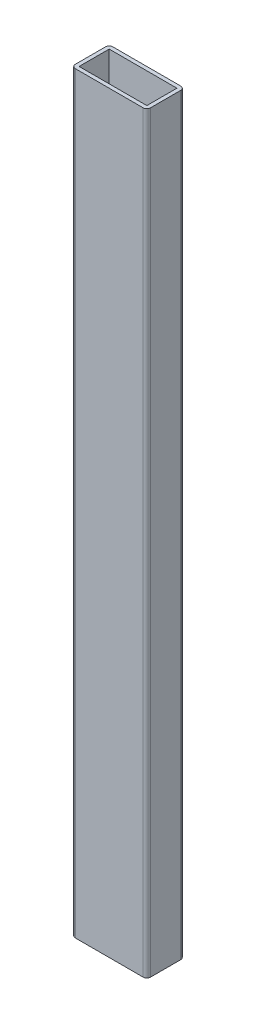
ISO-10303-21;
HEADER;
FILE_DESCRIPTION(('STEP AP214'),'2;1');
FILE_NAME('part.step','',(''),(''),'','','');
FILE_SCHEMA(('AUTOMOTIVE_DESIGN { 1 0 10303 214 1 1 1 1 }'));
ENDSEC;
DATA;
#1=APPLICATION_CONTEXT('core data for automotive mechanical design processes');
#2=APPLICATION_PROTOCOL_DEFINITION('international standard','automotive_design',2000,#1);
#3=PRODUCT_CONTEXT('',#1,'mechanical');
#4=PRODUCT('Part','Part','',(#3));
#5=PRODUCT_RELATED_PRODUCT_CATEGORY('part','',(#4));
#6=PRODUCT_DEFINITION_FORMATION('','',#4);
#7=PRODUCT_DEFINITION_CONTEXT('part definition',#1,'design');
#8=PRODUCT_DEFINITION('design','',#6,#7);
#9=PRODUCT_DEFINITION_SHAPE('','',#8);
#10=(LENGTH_UNIT() NAMED_UNIT(*) SI_UNIT(.MILLI.,.METRE.));
#11=(NAMED_UNIT(*) PLANE_ANGLE_UNIT() SI_UNIT($,.RADIAN.));
#12=(NAMED_UNIT(*) SI_UNIT($,.STERADIAN.) SOLID_ANGLE_UNIT());
#13=UNCERTAINTY_MEASURE_WITH_UNIT(LENGTH_MEASURE(1.E-05),#10,'distance_accuracy_value','');
#14=(GEOMETRIC_REPRESENTATION_CONTEXT(3) GLOBAL_UNCERTAINTY_ASSIGNED_CONTEXT((#13)) GLOBAL_UNIT_ASSIGNED_CONTEXT((#10,
#11,#12)) REPRESENTATION_CONTEXT('',''));
#15=CARTESIAN_POINT('',(0.,0.,0.));
#16=DIRECTION('',(0.,0.,1.));
#17=DIRECTION('',(1.,0.,0.));
#18=AXIS2_PLACEMENT_3D('',#15,#16,#17);
#19=CARTESIAN_POINT('',(-18.,400.,8.));
#20=DIRECTION('',(0.,1.,0.));
#21=DIRECTION('',(0.,0.,1.));
#22=AXIS2_PLACEMENT_3D('',#19,#20,#21);
#23=PLANE('',#22);
#24=CARTESIAN_POINT('',(-18.,400.,8.));
#25=DIRECTION('',(0.,1.,0.));
#26=DIRECTION('',(0.,0.,1.));
#27=AXIS2_PLACEMENT_3D('',#24,#25,#26);
#28=CIRCLE('',#27,2.);
#29=CARTESIAN_POINT('',(-20.,400.,7.99999999999999));
#30=VERTEX_POINT('',#29);
#31=CARTESIAN_POINT('',(-18.,400.,10.));
#32=VERTEX_POINT('',#31);
#33=EDGE_CURVE('E196',#30,#32,#28,.T.);
#34=ORIENTED_EDGE('',*,*,#33,.T.);
#35=DIRECTION('',(1.,0.,0.));
#36=VECTOR('',#35,1.);
#37=CARTESIAN_POINT('',(-18.,400.,10.));
#38=LINE('',#37,#36);
#39=CARTESIAN_POINT('',(18.,400.,10.));
#40=VERTEX_POINT('',#39);
#41=EDGE_CURVE('E199',#32,#40,#38,.T.);
#42=ORIENTED_EDGE('',*,*,#41,.T.);
#43=CARTESIAN_POINT('',(18.,400.,8.));
#44=DIRECTION('',(0.,1.,0.));
#45=DIRECTION('',(0.,0.,1.));
#46=AXIS2_PLACEMENT_3D('',#43,#44,#45);
#47=CIRCLE('',#46,2.);
#48=CARTESIAN_POINT('',(20.,400.,7.99999999999999));
#49=VERTEX_POINT('',#48);
#50=EDGE_CURVE('E202',#40,#49,#47,.T.);
#51=ORIENTED_EDGE('',*,*,#50,.T.);
#52=DIRECTION('',(0.,0.,-1.));
#53=VECTOR('',#52,1.);
#54=CARTESIAN_POINT('',(20.,400.,-7.99999999999999));
#55=LINE('',#54,#53);
#56=CARTESIAN_POINT('',(20.,400.,-7.99999999999999));
#57=VERTEX_POINT('',#56);
#58=EDGE_CURVE('E204',#49,#57,#55,.T.);
#59=ORIENTED_EDGE('',*,*,#58,.T.);
#60=CARTESIAN_POINT('',(18.,400.,-8.));
#61=DIRECTION('',(0.,1.,0.));
#62=DIRECTION('',(0.,0.,-1.));
#63=AXIS2_PLACEMENT_3D('',#60,#61,#62);
#64=CIRCLE('',#63,2.);
#65=CARTESIAN_POINT('',(18.,400.,-10.));
#66=VERTEX_POINT('',#65);
#67=EDGE_CURVE('E206',#57,#66,#64,.T.);
#68=ORIENTED_EDGE('',*,*,#67,.T.);
#69=DIRECTION('',(-1.,0.,0.));
#70=VECTOR('',#69,1.);
#71=CARTESIAN_POINT('',(-18.,400.,-10.));
#72=LINE('',#71,#70);
#73=CARTESIAN_POINT('',(-18.,400.,-10.));
#74=VERTEX_POINT('',#73);
#75=EDGE_CURVE('E208',#66,#74,#72,.T.);
#76=ORIENTED_EDGE('',*,*,#75,.T.);
#77=CARTESIAN_POINT('',(-18.,400.,-8.));
#78=DIRECTION('',(0.,1.,0.));
#79=DIRECTION('',(0.,0.,1.));
#80=AXIS2_PLACEMENT_3D('',#77,#78,#79);
#81=CIRCLE('',#80,2.);
#82=CARTESIAN_POINT('',(-20.,400.,-7.99999999999999));
#83=VERTEX_POINT('',#82);
#84=EDGE_CURVE('E210',#74,#83,#81,.T.);
#85=ORIENTED_EDGE('',*,*,#84,.T.);
#86=DIRECTION('',(0.,0.,1.));
#87=VECTOR('',#86,1.);
#88=CARTESIAN_POINT('',(-20.,400.,-7.99999999999999));
#89=LINE('',#88,#87);
#90=EDGE_CURVE('E212',#83,#30,#89,.T.);
#91=ORIENTED_EDGE('',*,*,#90,.T.);
#92=EDGE_LOOP('',(#34,#42,#51,#59,#68,#76,#85,#91));
#93=FACE_BOUND('',#92,.T.);
#94=DIRECTION('',(0.,0.,-1.));
#95=VECTOR('',#94,1.);
#96=CARTESIAN_POINT('',(18.,400.,-7.99999999999999));
#97=LINE('',#96,#95);
#98=CARTESIAN_POINT('',(18.,400.,8.));
#99=VERTEX_POINT('',#98);
#100=CARTESIAN_POINT('',(18.,400.,-8.));
#101=VERTEX_POINT('',#100);
#102=EDGE_CURVE('E168',#99,#101,#97,.T.);
#103=ORIENTED_EDGE('',*,*,#102,.F.);
#104=DIRECTION('',(1.,0.,0.));
#105=VECTOR('',#104,1.);
#106=CARTESIAN_POINT('',(-18.,400.,8.));
#107=LINE('',#106,#105);
#108=CARTESIAN_POINT('',(-18.,400.,8.));
#109=VERTEX_POINT('',#108);
#110=EDGE_CURVE('E160',#109,#99,#107,.T.);
#111=ORIENTED_EDGE('',*,*,#110,.F.);
#112=DIRECTION('',(0.,0.,1.));
#113=VECTOR('',#112,1.);
#114=CARTESIAN_POINT('',(-18.,400.,-7.99999999999999));
#115=LINE('',#114,#113);
#116=CARTESIAN_POINT('',(-18.,400.,-8.));
#117=VERTEX_POINT('',#116);
#118=EDGE_CURVE('E182',#117,#109,#115,.T.);
#119=ORIENTED_EDGE('',*,*,#118,.F.);
#120=DIRECTION('',(-1.,0.,0.));
#121=VECTOR('',#120,1.);
#122=CARTESIAN_POINT('',(-18.,400.,-8.));
#123=LINE('',#122,#121);
#124=EDGE_CURVE('E180',#101,#117,#123,.T.);
#125=ORIENTED_EDGE('',*,*,#124,.F.);
#126=EDGE_LOOP('',(#103,#111,#119,#125));
#127=FACE_BOUND('',#126,.T.);
#128=ADVANCED_FACE('F71',(#93,#127),#23,.T.);
#129=CARTESIAN_POINT('',(-18.,0.,8.));
#130=DIRECTION('',(0.,1.,0.));
#131=DIRECTION('',(0.,0.,1.));
#132=AXIS2_PLACEMENT_3D('',#129,#130,#131);
#133=PLANE('',#132);
#134=CARTESIAN_POINT('',(-18.,0.,8.));
#135=DIRECTION('',(0.,1.,0.));
#136=DIRECTION('',(0.,0.,1.));
#137=AXIS2_PLACEMENT_3D('',#134,#135,#136);
#138=CIRCLE('',#137,2.);
#139=CARTESIAN_POINT('',(-20.,0.,7.99999999999999));
#140=VERTEX_POINT('',#139);
#141=CARTESIAN_POINT('',(-18.,0.,10.));
#142=VERTEX_POINT('',#141);
#143=EDGE_CURVE('E176',#140,#142,#138,.T.);
#144=ORIENTED_EDGE('',*,*,#143,.F.);
#145=DIRECTION('',(0.,0.,1.));
#146=VECTOR('',#145,1.);
#147=CARTESIAN_POINT('',(-20.,0.,-7.99999999999999));
#148=LINE('',#147,#146);
#149=CARTESIAN_POINT('',(-20.,0.,-7.99999999999999));
#150=VERTEX_POINT('',#149);
#151=EDGE_CURVE('E200',#150,#140,#148,.T.);
#152=ORIENTED_EDGE('',*,*,#151,.F.);
#153=CARTESIAN_POINT('',(-18.,0.,-8.));
#154=DIRECTION('',(0.,1.,0.));
#155=DIRECTION('',(0.,0.,1.));
#156=AXIS2_PLACEMENT_3D('',#153,#154,#155);
#157=CIRCLE('',#156,2.);
#158=CARTESIAN_POINT('',(-18.,0.,-10.));
#159=VERTEX_POINT('',#158);
#160=EDGE_CURVE('E227',#159,#150,#157,.T.);
#161=ORIENTED_EDGE('',*,*,#160,.F.);
#162=DIRECTION('',(-1.,0.,0.));
#163=VECTOR('',#162,1.);
#164=CARTESIAN_POINT('',(-18.,0.,-10.));
#165=LINE('',#164,#163);
#166=CARTESIAN_POINT('',(18.,0.,-10.));
#167=VERTEX_POINT('',#166);
#168=EDGE_CURVE('E225',#167,#159,#165,.T.);
#169=ORIENTED_EDGE('',*,*,#168,.F.);
#170=CARTESIAN_POINT('',(18.,0.,-8.));
#171=DIRECTION('',(0.,1.,0.));
#172=DIRECTION('',(0.,0.,-1.));
#173=AXIS2_PLACEMENT_3D('',#170,#171,#172);
#174=CIRCLE('',#173,2.);
#175=CARTESIAN_POINT('',(20.,0.,-7.99999999999999));
#176=VERTEX_POINT('',#175);
#177=EDGE_CURVE('E223',#176,#167,#174,.T.);
#178=ORIENTED_EDGE('',*,*,#177,.F.);
#179=DIRECTION('',(0.,0.,-1.));
#180=VECTOR('',#179,1.);
#181=CARTESIAN_POINT('',(20.,0.,-7.99999999999999));
#182=LINE('',#181,#180);
#183=CARTESIAN_POINT('',(20.,0.,7.99999999999999));
#184=VERTEX_POINT('',#183);
#185=EDGE_CURVE('E221',#184,#176,#182,.T.);
#186=ORIENTED_EDGE('',*,*,#185,.F.);
#187=CARTESIAN_POINT('',(18.,0.,8.));
#188=DIRECTION('',(0.,1.,0.));
#189=DIRECTION('',(0.,0.,1.));
#190=AXIS2_PLACEMENT_3D('',#187,#188,#189);
#191=CIRCLE('',#190,2.);
#192=CARTESIAN_POINT('',(18.,0.,10.));
#193=VERTEX_POINT('',#192);
#194=EDGE_CURVE('E219',#193,#184,#191,.T.);
#195=ORIENTED_EDGE('',*,*,#194,.F.);
#196=DIRECTION('',(1.,0.,0.));
#197=VECTOR('',#196,1.);
#198=CARTESIAN_POINT('',(-18.,0.,10.));
#199=LINE('',#198,#197);
#200=EDGE_CURVE('E217',#142,#193,#199,.T.);
#201=ORIENTED_EDGE('',*,*,#200,.F.);
#202=EDGE_LOOP('',(#144,#152,#161,#169,#178,#186,#195,#201));
#203=FACE_BOUND('',#202,.T.);
#204=DIRECTION('',(1.,0.,0.));
#205=VECTOR('',#204,1.);
#206=CARTESIAN_POINT('',(-18.,0.,8.));
#207=LINE('',#206,#205);
#208=CARTESIAN_POINT('',(-18.,0.,8.));
#209=VERTEX_POINT('',#208);
#210=CARTESIAN_POINT('',(18.,0.,8.));
#211=VERTEX_POINT('',#210);
#212=EDGE_CURVE('E94',#209,#211,#207,.T.);
#213=ORIENTED_EDGE('',*,*,#212,.T.);
#214=DIRECTION('',(0.,0.,-1.));
#215=VECTOR('',#214,1.);
#216=CARTESIAN_POINT('',(18.,0.,-7.99999999999999));
#217=LINE('',#216,#215);
#218=CARTESIAN_POINT('',(18.,0.,-8.));
#219=VERTEX_POINT('',#218);
#220=EDGE_CURVE('E175',#211,#219,#217,.T.);
#221=ORIENTED_EDGE('',*,*,#220,.T.);
#222=DIRECTION('',(-1.,0.,0.));
#223=VECTOR('',#222,1.);
#224=CARTESIAN_POINT('',(-18.,0.,-8.));
#225=LINE('',#224,#223);
#226=CARTESIAN_POINT('',(-18.,0.,-8.));
#227=VERTEX_POINT('',#226);
#228=EDGE_CURVE('E188',#219,#227,#225,.T.);
#229=ORIENTED_EDGE('',*,*,#228,.T.);
#230=DIRECTION('',(0.,0.,1.));
#231=VECTOR('',#230,1.);
#232=CARTESIAN_POINT('',(-18.,0.,-7.99999999999999));
#233=LINE('',#232,#231);
#234=EDGE_CURVE('E169',#227,#209,#233,.T.);
#235=ORIENTED_EDGE('',*,*,#234,.T.);
#236=EDGE_LOOP('',(#213,#221,#229,#235));
#237=FACE_BOUND('',#236,.T.);
#238=ADVANCED_FACE('F257',(#203,#237),#133,.F.);
#239=CARTESIAN_POINT('',(-18.,400.,8.));
#240=DIRECTION('',(0.,-1.,0.));
#241=DIRECTION('',(0.,0.,-1.));
#242=AXIS2_PLACEMENT_3D('',#239,#240,#241);
#243=CYLINDRICAL_SURFACE('',#242,2.);
#244=ORIENTED_EDGE('',*,*,#143,.T.);
#245=DIRECTION('',(0.,-1.,0.));
#246=VECTOR('',#245,1.);
#247=CARTESIAN_POINT('',(-18.,400.,10.));
#248=LINE('',#247,#246);
#249=EDGE_CURVE('E12',#32,#142,#248,.T.);
#250=ORIENTED_EDGE('',*,*,#249,.F.);
#251=ORIENTED_EDGE('',*,*,#33,.F.);
#252=DIRECTION('',(0.,-1.,0.));
#253=VECTOR('',#252,1.);
#254=CARTESIAN_POINT('',(-20.,400.,7.99999999999999));
#255=LINE('',#254,#253);
#256=EDGE_CURVE('E214',#30,#140,#255,.T.);
#257=ORIENTED_EDGE('',*,*,#256,.T.);
#258=EDGE_LOOP('',(#244,#250,#251,#257));
#259=FACE_BOUND('',#258,.T.);
#260=ADVANCED_FACE('F73',(#259),#243,.T.);
#261=CARTESIAN_POINT('',(-18.,400.,10.));
#262=DIRECTION('',(0.,0.,-1.));
#263=DIRECTION('',(-1.,0.,0.));
#264=AXIS2_PLACEMENT_3D('',#261,#262,#263);
#265=PLANE('',#264);
#266=ORIENTED_EDGE('',*,*,#200,.T.);
#267=DIRECTION('',(0.,-1.,0.));
#268=VECTOR('',#267,1.);
#269=CARTESIAN_POINT('',(18.,400.,10.));
#270=LINE('',#269,#268);
#271=EDGE_CURVE('E79',#40,#193,#270,.T.);
#272=ORIENTED_EDGE('',*,*,#271,.F.);
#273=ORIENTED_EDGE('',*,*,#41,.F.);
#274=ORIENTED_EDGE('',*,*,#249,.T.);
#275=EDGE_LOOP('',(#266,#272,#273,#274));
#276=FACE_BOUND('',#275,.T.);
#277=ADVANCED_FACE('F274',(#276),#265,.F.);
#278=CARTESIAN_POINT('',(18.,400.,8.));
#279=DIRECTION('',(0.,-1.,0.));
#280=DIRECTION('',(0.,0.,-1.));
#281=AXIS2_PLACEMENT_3D('',#278,#279,#280);
#282=CYLINDRICAL_SURFACE('',#281,2.);
#283=ORIENTED_EDGE('',*,*,#194,.T.);
#284=DIRECTION('',(0.,-1.,0.));
#285=VECTOR('',#284,1.);
#286=CARTESIAN_POINT('',(20.,400.,7.99999999999999));
#287=LINE('',#286,#285);
#288=EDGE_CURVE('E244',#49,#184,#287,.T.);
#289=ORIENTED_EDGE('',*,*,#288,.F.);
#290=ORIENTED_EDGE('',*,*,#50,.F.);
#291=ORIENTED_EDGE('',*,*,#271,.T.);
#292=EDGE_LOOP('',(#283,#289,#290,#291));
#293=FACE_BOUND('',#292,.T.);
#294=ADVANCED_FACE('F251',(#293),#282,.T.);
#295=CARTESIAN_POINT('',(20.,400.,-7.99999999999999));
#296=DIRECTION('',(-1.,0.,0.));
#297=DIRECTION('',(0.,0.,1.));
#298=AXIS2_PLACEMENT_3D('',#295,#296,#297);
#299=PLANE('',#298);
#300=ORIENTED_EDGE('',*,*,#185,.T.);
#301=DIRECTION('',(0.,-1.,0.));
#302=VECTOR('',#301,1.);
#303=CARTESIAN_POINT('',(20.,400.,-7.99999999999999));
#304=LINE('',#303,#302);
#305=EDGE_CURVE('E241',#57,#176,#304,.T.);
#306=ORIENTED_EDGE('',*,*,#305,.F.);
#307=ORIENTED_EDGE('',*,*,#58,.F.);
#308=ORIENTED_EDGE('',*,*,#288,.T.);
#309=EDGE_LOOP('',(#300,#306,#307,#308));
#310=FACE_BOUND('',#309,.T.);
#311=ADVANCED_FACE('F263',(#310),#299,.F.);
#312=CARTESIAN_POINT('',(18.,400.,-8.));
#313=DIRECTION('',(0.,-1.,0.));
#314=DIRECTION('',(0.,0.,-1.));
#315=AXIS2_PLACEMENT_3D('',#312,#313,#314);
#316=CYLINDRICAL_SURFACE('',#315,2.);
#317=ORIENTED_EDGE('',*,*,#177,.T.);
#318=DIRECTION('',(0.,-1.,0.));
#319=VECTOR('',#318,1.);
#320=CARTESIAN_POINT('',(18.,400.,-10.));
#321=LINE('',#320,#319);
#322=EDGE_CURVE('E238',#66,#167,#321,.T.);
#323=ORIENTED_EDGE('',*,*,#322,.F.);
#324=ORIENTED_EDGE('',*,*,#67,.F.);
#325=ORIENTED_EDGE('',*,*,#305,.T.);
#326=EDGE_LOOP('',(#317,#323,#324,#325));
#327=FACE_BOUND('',#326,.T.);
#328=ADVANCED_FACE('F267',(#327),#316,.T.);
#329=CARTESIAN_POINT('',(-18.,400.,-10.));
#330=DIRECTION('',(0.,0.,1.));
#331=DIRECTION('',(1.,0.,0.));
#332=AXIS2_PLACEMENT_3D('',#329,#330,#331);
#333=PLANE('',#332);
#334=ORIENTED_EDGE('',*,*,#168,.T.);
#335=DIRECTION('',(0.,-1.,0.));
#336=VECTOR('',#335,1.);
#337=CARTESIAN_POINT('',(-18.,400.,-10.));
#338=LINE('',#337,#336);
#339=EDGE_CURVE('E235',#74,#159,#338,.T.);
#340=ORIENTED_EDGE('',*,*,#339,.F.);
#341=ORIENTED_EDGE('',*,*,#75,.F.);
#342=ORIENTED_EDGE('',*,*,#322,.T.);
#343=EDGE_LOOP('',(#334,#340,#341,#342));
#344=FACE_BOUND('',#343,.T.);
#345=ADVANCED_FACE('F287',(#344),#333,.F.);
#346=CARTESIAN_POINT('',(-18.,400.,-8.));
#347=DIRECTION('',(0.,-1.,0.));
#348=DIRECTION('',(0.,0.,-1.));
#349=AXIS2_PLACEMENT_3D('',#346,#347,#348);
#350=CYLINDRICAL_SURFACE('',#349,2.);
#351=ORIENTED_EDGE('',*,*,#160,.T.);
#352=DIRECTION('',(0.,-1.,0.));
#353=VECTOR('',#352,1.);
#354=CARTESIAN_POINT('',(-20.,400.,-7.99999999999999));
#355=LINE('',#354,#353);
#356=EDGE_CURVE('E232',#83,#150,#355,.T.);
#357=ORIENTED_EDGE('',*,*,#356,.F.);
#358=ORIENTED_EDGE('',*,*,#84,.F.);
#359=ORIENTED_EDGE('',*,*,#339,.T.);
#360=EDGE_LOOP('',(#351,#357,#358,#359));
#361=FACE_BOUND('',#360,.T.);
#362=ADVANCED_FACE('F285',(#361),#350,.T.);
#363=CARTESIAN_POINT('',(-20.,400.,-7.99999999999999));
#364=DIRECTION('',(1.,0.,0.));
#365=DIRECTION('',(0.,0.,-1.));
#366=AXIS2_PLACEMENT_3D('',#363,#364,#365);
#367=PLANE('',#366);
#368=ORIENTED_EDGE('',*,*,#151,.T.);
#369=ORIENTED_EDGE('',*,*,#256,.F.);
#370=ORIENTED_EDGE('',*,*,#90,.F.);
#371=ORIENTED_EDGE('',*,*,#356,.T.);
#372=EDGE_LOOP('',(#368,#369,#370,#371));
#373=FACE_BOUND('',#372,.T.);
#374=ADVANCED_FACE('F280',(#373),#367,.F.);
#375=CARTESIAN_POINT('',(-18.,400.,8.));
#376=DIRECTION('',(0.,0.,-1.));
#377=DIRECTION('',(-1.,0.,0.));
#378=AXIS2_PLACEMENT_3D('',#375,#376,#377);
#379=PLANE('',#378);
#380=ORIENTED_EDGE('',*,*,#212,.F.);
#381=DIRECTION('',(0.,-1.,0.));
#382=VECTOR('',#381,1.);
#383=CARTESIAN_POINT('',(-18.,400.,8.));
#384=LINE('',#383,#382);
#385=EDGE_CURVE('E164',#109,#209,#384,.T.);
#386=ORIENTED_EDGE('',*,*,#385,.F.);
#387=ORIENTED_EDGE('',*,*,#110,.T.);
#388=DIRECTION('',(0.,-1.,0.));
#389=VECTOR('',#388,1.);
#390=CARTESIAN_POINT('',(18.,400.,8.));
#391=LINE('',#390,#389);
#392=EDGE_CURVE('E163',#99,#211,#391,.T.);
#393=ORIENTED_EDGE('',*,*,#392,.T.);
#394=EDGE_LOOP('',(#380,#386,#387,#393));
#395=FACE_BOUND('',#394,.T.);
#396=ADVANCED_FACE('F162',(#395),#379,.T.);
#397=CARTESIAN_POINT('',(18.,400.,-7.99999999999999));
#398=DIRECTION('',(-1.,0.,0.));
#399=DIRECTION('',(0.,0.,1.));
#400=AXIS2_PLACEMENT_3D('',#397,#398,#399);
#401=PLANE('',#400);
#402=ORIENTED_EDGE('',*,*,#220,.F.);
#403=ORIENTED_EDGE('',*,*,#392,.F.);
#404=ORIENTED_EDGE('',*,*,#102,.T.);
#405=DIRECTION('',(0.,-1.,0.));
#406=VECTOR('',#405,1.);
#407=CARTESIAN_POINT('',(18.,400.,-8.));
#408=LINE('',#407,#406);
#409=EDGE_CURVE('E177',#101,#219,#408,.T.);
#410=ORIENTED_EDGE('',*,*,#409,.T.);
#411=EDGE_LOOP('',(#402,#403,#404,#410));
#412=FACE_BOUND('',#411,.T.);
#413=ADVANCED_FACE('F172',(#412),#401,.T.);
#414=CARTESIAN_POINT('',(-18.,400.,-8.));
#415=DIRECTION('',(0.,0.,1.));
#416=DIRECTION('',(1.,0.,0.));
#417=AXIS2_PLACEMENT_3D('',#414,#415,#416);
#418=PLANE('',#417);
#419=ORIENTED_EDGE('',*,*,#228,.F.);
#420=ORIENTED_EDGE('',*,*,#409,.F.);
#421=ORIENTED_EDGE('',*,*,#124,.T.);
#422=DIRECTION('',(0.,-1.,0.));
#423=VECTOR('',#422,1.);
#424=CARTESIAN_POINT('',(-18.,400.,-8.));
#425=LINE('',#424,#423);
#426=EDGE_CURVE('E86',#117,#227,#425,.T.);
#427=ORIENTED_EDGE('',*,*,#426,.T.);
#428=EDGE_LOOP('',(#419,#420,#421,#427));
#429=FACE_BOUND('',#428,.T.);
#430=ADVANCED_FACE('F312',(#429),#418,.T.);
#431=CARTESIAN_POINT('',(-18.,400.,-7.99999999999999));
#432=DIRECTION('',(1.,0.,0.));
#433=DIRECTION('',(0.,0.,-1.));
#434=AXIS2_PLACEMENT_3D('',#431,#432,#433);
#435=PLANE('',#434);
#436=ORIENTED_EDGE('',*,*,#234,.F.);
#437=ORIENTED_EDGE('',*,*,#426,.F.);
#438=ORIENTED_EDGE('',*,*,#118,.T.);
#439=ORIENTED_EDGE('',*,*,#385,.T.);
#440=EDGE_LOOP('',(#436,#437,#438,#439));
#441=FACE_BOUND('',#440,.T.);
#442=ADVANCED_FACE('F316',(#441),#435,.T.);
#443=CLOSED_SHELL('',(#128,#238,#260,#277,#294,#311,#328,#345,#362,#374,#396,#413,#430,#442));
#444=MANIFOLD_SOLID_BREP('B2',#443);
#445=ADVANCED_BREP_SHAPE_REPRESENTATION('',(#18,#444),#14);
#446=SHAPE_DEFINITION_REPRESENTATION(#9,#445);
ENDSEC;
END-ISO-10303-21;
